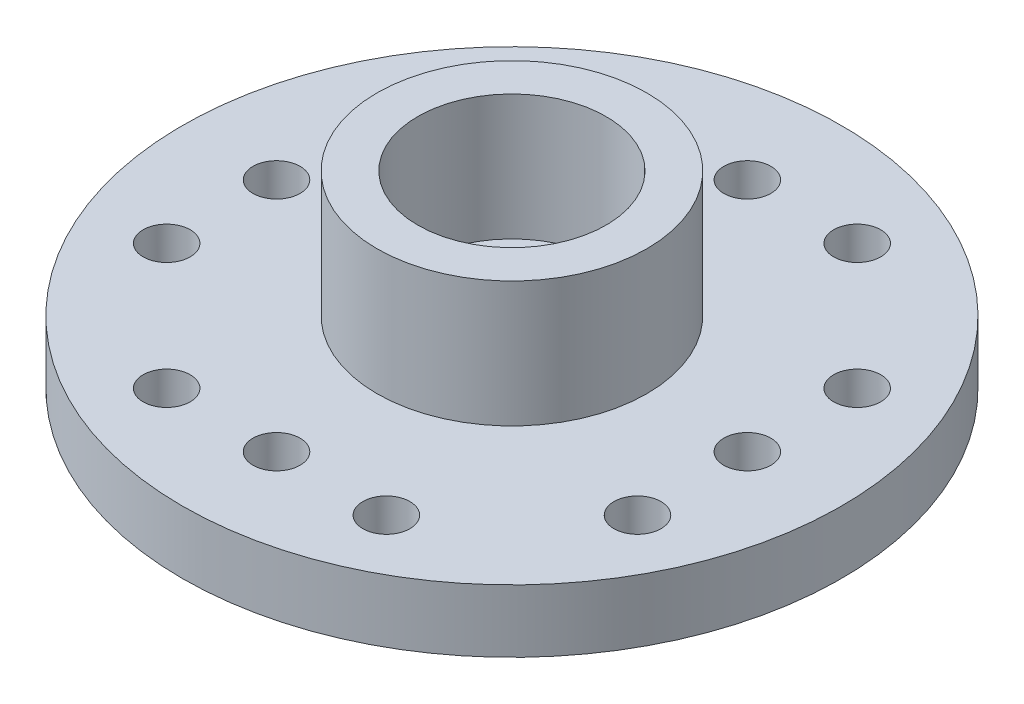
ISO-10303-21;
HEADER;
FILE_DESCRIPTION(('STEP AP214'),'2;1');
FILE_NAME('part.step','',(''),(''),'','','');
FILE_SCHEMA(('AUTOMOTIVE_DESIGN { 1 0 10303 214 1 1 1 1 }'));
ENDSEC;
DATA;
#1=APPLICATION_CONTEXT('core data for automotive mechanical design processes');
#2=APPLICATION_PROTOCOL_DEFINITION('international standard','automotive_design',2000,#1);
#3=PRODUCT_CONTEXT('',#1,'mechanical');
#4=PRODUCT('Part','Part','',(#3));
#5=PRODUCT_RELATED_PRODUCT_CATEGORY('part','',(#4));
#6=PRODUCT_DEFINITION_FORMATION('','',#4);
#7=PRODUCT_DEFINITION_CONTEXT('part definition',#1,'design');
#8=PRODUCT_DEFINITION('design','',#6,#7);
#9=PRODUCT_DEFINITION_SHAPE('','',#8);
#10=(LENGTH_UNIT() NAMED_UNIT(*) SI_UNIT(.MILLI.,.METRE.));
#11=(NAMED_UNIT(*) PLANE_ANGLE_UNIT() SI_UNIT($,.RADIAN.));
#12=(NAMED_UNIT(*) SI_UNIT($,.STERADIAN.) SOLID_ANGLE_UNIT());
#13=UNCERTAINTY_MEASURE_WITH_UNIT(LENGTH_MEASURE(1.E-05),#10,'distance_accuracy_value','');
#14=(GEOMETRIC_REPRESENTATION_CONTEXT(3) GLOBAL_UNCERTAINTY_ASSIGNED_CONTEXT((#13)) GLOBAL_UNIT_ASSIGNED_CONTEXT((#10,
#11,#12)) REPRESENTATION_CONTEXT('',''));
#15=CARTESIAN_POINT('',(0.,0.,0.));
#16=DIRECTION('',(0.,0.,1.));
#17=DIRECTION('',(1.,0.,0.));
#18=AXIS2_PLACEMENT_3D('',#15,#16,#17);
#19=CARTESIAN_POINT('',(0.,0.,0.));
#20=DIRECTION('',(0.,1.,0.));
#21=DIRECTION('',(0.,0.,1.));
#22=AXIS2_PLACEMENT_3D('',#19,#20,#21);
#23=PLANE('',#22);
#24=CARTESIAN_POINT('',(-7.49999999999916,0.,3.50000000000044));
#25=DIRECTION('',(0.,1.,0.));
#26=DIRECTION('',(0.,0.,1.));
#27=AXIS2_PLACEMENT_3D('',#24,#25,#26);
#28=CIRCLE('',#27,0.749999999999759);
#29=CARTESIAN_POINT('',(-7.49999999999916,0.,4.2500000000002));
#30=VERTEX_POINT('',#29);
#31=EDGE_CURVE('E95',#30,#30,#28,.F.);
#32=ORIENTED_EDGE('',*,*,#31,.F.);
#33=EDGE_LOOP('',(#32));
#34=FACE_BOUND('',#33,.T.);
#35=CARTESIAN_POINT('',(-7.49999999999916,0.,4.40862624184729E-13));
#36=DIRECTION('',(0.,1.,0.));
#37=DIRECTION('',(0.,0.,1.));
#38=AXIS2_PLACEMENT_3D('',#35,#36,#37);
#39=CIRCLE('',#38,0.750000000000742);
#40=CARTESIAN_POINT('',(-7.49999999999916,0.,0.750000000001182));
#41=VERTEX_POINT('',#40);
#42=EDGE_CURVE('E102',#41,#41,#39,.F.);
#43=ORIENTED_EDGE('',*,*,#42,.F.);
#44=EDGE_LOOP('',(#43));
#45=FACE_BOUND('',#44,.T.);
#46=CARTESIAN_POINT('',(-7.49999999999916,0.,-3.49999999999956));
#47=DIRECTION('',(0.,1.,0.));
#48=DIRECTION('',(0.,0.,1.));
#49=AXIS2_PLACEMENT_3D('',#46,#47,#48);
#50=CIRCLE('',#49,0.75000000000073);
#51=CARTESIAN_POINT('',(-7.49999999999916,0.,-2.74999999999883));
#52=VERTEX_POINT('',#51);
#53=EDGE_CURVE('E108',#52,#52,#50,.F.);
#54=ORIENTED_EDGE('',*,*,#53,.F.);
#55=EDGE_LOOP('',(#54));
#56=FACE_BOUND('',#55,.T.);
#57=CARTESIAN_POINT('',(3.50000000000128,0.,7.4999999999996));
#58=DIRECTION('',(0.,1.,0.));
#59=DIRECTION('',(0.,0.,1.));
#60=AXIS2_PLACEMENT_3D('',#57,#58,#59);
#61=CIRCLE('',#60,0.749999999998852);
#62=CARTESIAN_POINT('',(3.50000000000128,0.,8.24999999999845));
#63=VERTEX_POINT('',#62);
#64=EDGE_CURVE('E114',#63,#63,#61,.F.);
#65=ORIENTED_EDGE('',*,*,#64,.F.);
#66=EDGE_LOOP('',(#65));
#67=FACE_BOUND('',#66,.T.);
#68=CARTESIAN_POINT('',(1.27713995416943E-12,0.,7.4999999999996));
#69=DIRECTION('',(0.,1.,0.));
#70=DIRECTION('',(0.,0.,1.));
#71=AXIS2_PLACEMENT_3D('',#68,#69,#70);
#72=CIRCLE('',#71,0.750000000001387);
#73=CARTESIAN_POINT('',(1.27713995416943E-12,0.,8.25000000000099));
#74=VERTEX_POINT('',#73);
#75=EDGE_CURVE('E120',#74,#74,#72,.F.);
#76=ORIENTED_EDGE('',*,*,#75,.F.);
#77=EDGE_LOOP('',(#76));
#78=FACE_BOUND('',#77,.T.);
#79=CARTESIAN_POINT('',(-3.49999999999872,0.,7.4999999999996));
#80=DIRECTION('',(0.,1.,0.));
#81=DIRECTION('',(0.,0.,1.));
#82=AXIS2_PLACEMENT_3D('',#79,#80,#81);
#83=CIRCLE('',#82,0.75000000000138);
#84=CARTESIAN_POINT('',(-3.49999999999872,0.,8.25000000000098));
#85=VERTEX_POINT('',#84);
#86=EDGE_CURVE('E72',#85,#85,#83,.F.);
#87=ORIENTED_EDGE('',*,*,#86,.F.);
#88=EDGE_LOOP('',(#87));
#89=FACE_BOUND('',#88,.T.);
#90=CARTESIAN_POINT('',(7.50000000000044,0.,-3.50000000000084));
#91=DIRECTION('',(0.,1.,0.));
#92=DIRECTION('',(0.,0.,1.));
#93=AXIS2_PLACEMENT_3D('',#90,#91,#92);
#94=CIRCLE('',#93,0.74999999999905);
#95=CARTESIAN_POINT('',(7.50000000000044,0.,-2.75000000000179));
#96=VERTEX_POINT('',#95);
#97=EDGE_CURVE('E65',#96,#96,#94,.F.);
#98=ORIENTED_EDGE('',*,*,#97,.F.);
#99=EDGE_LOOP('',(#98));
#100=FACE_BOUND('',#99,.T.);
#101=CARTESIAN_POINT('',(7.50000000000044,0.,-8.37195815084057E-13));
#102=DIRECTION('',(0.,1.,0.));
#103=DIRECTION('',(0.,0.,1.));
#104=AXIS2_PLACEMENT_3D('',#101,#102,#103);
#105=CIRCLE('',#104,0.750000000000697);
#106=CARTESIAN_POINT('',(7.50000000000044,0.,0.74999999999986));
#107=VERTEX_POINT('',#106);
#108=EDGE_CURVE('E73',#107,#107,#105,.F.);
#109=ORIENTED_EDGE('',*,*,#108,.F.);
#110=EDGE_LOOP('',(#109));
#111=FACE_BOUND('',#110,.T.);
#112=CARTESIAN_POINT('',(7.50000000000044,0.,3.49999999999916));
#113=DIRECTION('',(0.,1.,0.));
#114=DIRECTION('',(0.,0.,1.));
#115=AXIS2_PLACEMENT_3D('',#112,#113,#114);
#116=CIRCLE('',#115,0.750000000000693);
#117=CARTESIAN_POINT('',(7.50000000000044,0.,4.24999999999986));
#118=VERTEX_POINT('',#117);
#119=EDGE_CURVE('E79',#118,#118,#116,.F.);
#120=ORIENTED_EDGE('',*,*,#119,.F.);
#121=EDGE_LOOP('',(#120));
#122=FACE_BOUND('',#121,.T.);
#123=CARTESIAN_POINT('',(-3.5,0.,-7.5));
#124=DIRECTION('',(0.,1.,0.));
#125=DIRECTION('',(0.,0.,1.));
#126=AXIS2_PLACEMENT_3D('',#123,#124,#125);
#127=CIRCLE('',#126,0.75);
#128=CARTESIAN_POINT('',(-3.5,0.,-6.75));
#129=VERTEX_POINT('',#128);
#130=EDGE_CURVE('E85',#129,#129,#127,.F.);
#131=ORIENTED_EDGE('',*,*,#130,.F.);
#132=EDGE_LOOP('',(#131));
#133=FACE_BOUND('',#132,.T.);
#134=CARTESIAN_POINT('',(0.,0.,-7.5));
#135=DIRECTION('',(0.,1.,0.));
#136=DIRECTION('',(0.,0.,1.));
#137=AXIS2_PLACEMENT_3D('',#134,#135,#136);
#138=CIRCLE('',#137,0.75);
#139=CARTESIAN_POINT('',(0.,0.,-6.75));
#140=VERTEX_POINT('',#139);
#141=EDGE_CURVE('E64',#140,#140,#138,.F.);
#142=ORIENTED_EDGE('',*,*,#141,.F.);
#143=EDGE_LOOP('',(#142));
#144=FACE_BOUND('',#143,.T.);
#145=CARTESIAN_POINT('',(3.5,0.,-7.5));
#146=DIRECTION('',(0.,1.,0.));
#147=DIRECTION('',(0.,0.,1.));
#148=AXIS2_PLACEMENT_3D('',#145,#146,#147);
#149=CIRCLE('',#148,0.75);
#150=CARTESIAN_POINT('',(3.5,0.,-6.75));
#151=VERTEX_POINT('',#150);
#152=EDGE_CURVE('E58',#151,#151,#149,.F.);
#153=ORIENTED_EDGE('',*,*,#152,.F.);
#154=EDGE_LOOP('',(#153));
#155=FACE_BOUND('',#154,.T.);
#156=CARTESIAN_POINT('',(0.,0.,0.));
#157=DIRECTION('',(0.,1.,0.));
#158=DIRECTION('',(0.,0.,1.));
#159=AXIS2_PLACEMENT_3D('',#156,#157,#158);
#160=CIRCLE('',#159,10.5);
#161=CARTESIAN_POINT('',(0.,0.,10.5));
#162=VERTEX_POINT('',#161);
#163=EDGE_CURVE('E10',#162,#162,#160,.T.);
#164=ORIENTED_EDGE('',*,*,#163,.F.);
#165=EDGE_LOOP('',(#164));
#166=FACE_BOUND('',#165,.T.);
#167=ADVANCED_FACE('F33',(#34,#45,#56,#67,#78,#89,#100,#111,#122,#133,#144,#155,#166),#23,.F.);
#168=CARTESIAN_POINT('',(0.,2.,0.));
#169=DIRECTION('',(0.,1.,0.));
#170=DIRECTION('',(0.,0.,1.));
#171=AXIS2_PLACEMENT_3D('',#168,#169,#170);
#172=CYLINDRICAL_SURFACE('',#171,10.5);
#173=CARTESIAN_POINT('',(0.,2.,0.));
#174=DIRECTION('',(0.,1.,0.));
#175=DIRECTION('',(0.,0.,1.));
#176=AXIS2_PLACEMENT_3D('',#173,#174,#175);
#177=CIRCLE('',#176,10.5);
#178=CARTESIAN_POINT('',(0.,2.,10.5));
#179=VERTEX_POINT('',#178);
#180=EDGE_CURVE('E39',#179,#179,#177,.T.);
#181=ORIENTED_EDGE('',*,*,#180,.F.);
#182=EDGE_LOOP('',(#181));
#183=FACE_BOUND('',#182,.T.);
#184=ORIENTED_EDGE('',*,*,#163,.T.);
#185=EDGE_LOOP('',(#184));
#186=FACE_BOUND('',#185,.T.);
#187=ADVANCED_FACE('F138',(#183,#186),#172,.T.);
#188=CARTESIAN_POINT('',(10.5,2.,0.));
#189=DIRECTION('',(0.,-1.,0.));
#190=DIRECTION('',(0.,0.,-1.));
#191=AXIS2_PLACEMENT_3D('',#188,#189,#190);
#192=PLANE('',#191);
#193=CARTESIAN_POINT('',(-7.49999999999916,2.,3.50000000000044));
#194=DIRECTION('',(0.,1.,0.));
#195=DIRECTION('',(0.,0.,-1.));
#196=AXIS2_PLACEMENT_3D('',#193,#194,#195);
#197=CIRCLE('',#196,0.749999999999759);
#198=CARTESIAN_POINT('',(-7.49999999999916,2.,2.75000000000068));
#199=VERTEX_POINT('',#198);
#200=EDGE_CURVE('E99',#199,#199,#197,.T.);
#201=ORIENTED_EDGE('',*,*,#200,.F.);
#202=EDGE_LOOP('',(#201));
#203=FACE_BOUND('',#202,.T.);
#204=CARTESIAN_POINT('',(-7.49999999999916,2.,4.40862624184729E-13));
#205=DIRECTION('',(0.,1.,0.));
#206=DIRECTION('',(0.,0.,1.));
#207=AXIS2_PLACEMENT_3D('',#204,#205,#206);
#208=CIRCLE('',#207,0.750000000000742);
#209=CARTESIAN_POINT('',(-7.49999999999916,2.,0.750000000001182));
#210=VERTEX_POINT('',#209);
#211=EDGE_CURVE('E98',#210,#210,#208,.T.);
#212=ORIENTED_EDGE('',*,*,#211,.F.);
#213=EDGE_LOOP('',(#212));
#214=FACE_BOUND('',#213,.T.);
#215=CARTESIAN_POINT('',(-7.49999999999916,2.,-3.49999999999956));
#216=DIRECTION('',(0.,1.,0.));
#217=DIRECTION('',(0.,0.,1.));
#218=AXIS2_PLACEMENT_3D('',#215,#216,#217);
#219=CIRCLE('',#218,0.75000000000073);
#220=CARTESIAN_POINT('',(-7.49999999999916,2.,-2.74999999999883));
#221=VERTEX_POINT('',#220);
#222=EDGE_CURVE('E105',#221,#221,#219,.T.);
#223=ORIENTED_EDGE('',*,*,#222,.F.);
#224=EDGE_LOOP('',(#223));
#225=FACE_BOUND('',#224,.T.);
#226=CARTESIAN_POINT('',(3.50000000000128,2.,7.4999999999996));
#227=DIRECTION('',(0.,1.,0.));
#228=DIRECTION('',(0.,0.,-1.));
#229=AXIS2_PLACEMENT_3D('',#226,#227,#228);
#230=CIRCLE('',#229,0.749999999998852);
#231=CARTESIAN_POINT('',(3.50000000000128,2.,6.75000000000075));
#232=VERTEX_POINT('',#231);
#233=EDGE_CURVE('E111',#232,#232,#230,.T.);
#234=ORIENTED_EDGE('',*,*,#233,.F.);
#235=EDGE_LOOP('',(#234));
#236=FACE_BOUND('',#235,.T.);
#237=CARTESIAN_POINT('',(1.27713995416943E-12,2.,7.4999999999996));
#238=DIRECTION('',(0.,1.,0.));
#239=DIRECTION('',(0.,0.,1.));
#240=AXIS2_PLACEMENT_3D('',#237,#238,#239);
#241=CIRCLE('',#240,0.750000000001387);
#242=CARTESIAN_POINT('',(1.27713995416943E-12,2.,8.25000000000099));
#243=VERTEX_POINT('',#242);
#244=EDGE_CURVE('E117',#243,#243,#241,.T.);
#245=ORIENTED_EDGE('',*,*,#244,.F.);
#246=EDGE_LOOP('',(#245));
#247=FACE_BOUND('',#246,.T.);
#248=CARTESIAN_POINT('',(-3.49999999999872,2.,7.4999999999996));
#249=DIRECTION('',(0.,1.,0.));
#250=DIRECTION('',(0.,0.,1.));
#251=AXIS2_PLACEMENT_3D('',#248,#249,#250);
#252=CIRCLE('',#251,0.75000000000138);
#253=CARTESIAN_POINT('',(-3.49999999999872,2.,8.25000000000098));
#254=VERTEX_POINT('',#253);
#255=EDGE_CURVE('E123',#254,#254,#252,.T.);
#256=ORIENTED_EDGE('',*,*,#255,.F.);
#257=EDGE_LOOP('',(#256));
#258=FACE_BOUND('',#257,.T.);
#259=CARTESIAN_POINT('',(7.50000000000044,2.,-3.50000000000084));
#260=DIRECTION('',(0.,1.,0.));
#261=DIRECTION('',(0.,0.,-1.));
#262=AXIS2_PLACEMENT_3D('',#259,#260,#261);
#263=CIRCLE('',#262,0.74999999999905);
#264=CARTESIAN_POINT('',(7.50000000000044,2.,-4.24999999999989));
#265=VERTEX_POINT('',#264);
#266=EDGE_CURVE('E69',#265,#265,#263,.T.);
#267=ORIENTED_EDGE('',*,*,#266,.F.);
#268=EDGE_LOOP('',(#267));
#269=FACE_BOUND('',#268,.T.);
#270=CARTESIAN_POINT('',(7.50000000000044,2.,-8.37195815084057E-13));
#271=DIRECTION('',(0.,1.,0.));
#272=DIRECTION('',(0.,0.,1.));
#273=AXIS2_PLACEMENT_3D('',#270,#271,#272);
#274=CIRCLE('',#273,0.750000000000697);
#275=CARTESIAN_POINT('',(7.50000000000044,2.,0.74999999999986));
#276=VERTEX_POINT('',#275);
#277=EDGE_CURVE('E68',#276,#276,#274,.T.);
#278=ORIENTED_EDGE('',*,*,#277,.F.);
#279=EDGE_LOOP('',(#278));
#280=FACE_BOUND('',#279,.T.);
#281=CARTESIAN_POINT('',(7.50000000000044,2.,3.49999999999916));
#282=DIRECTION('',(0.,1.,0.));
#283=DIRECTION('',(0.,0.,1.));
#284=AXIS2_PLACEMENT_3D('',#281,#282,#283);
#285=CIRCLE('',#284,0.750000000000693);
#286=CARTESIAN_POINT('',(7.50000000000044,2.,4.24999999999986));
#287=VERTEX_POINT('',#286);
#288=EDGE_CURVE('E76',#287,#287,#285,.T.);
#289=ORIENTED_EDGE('',*,*,#288,.F.);
#290=EDGE_LOOP('',(#289));
#291=FACE_BOUND('',#290,.T.);
#292=CARTESIAN_POINT('',(-3.5,2.,-7.5));
#293=DIRECTION('',(0.,1.,0.));
#294=DIRECTION('',(0.,0.,-1.));
#295=AXIS2_PLACEMENT_3D('',#292,#293,#294);
#296=CIRCLE('',#295,0.75);
#297=CARTESIAN_POINT('',(-3.5,2.,-8.25));
#298=VERTEX_POINT('',#297);
#299=EDGE_CURVE('E82',#298,#298,#296,.T.);
#300=ORIENTED_EDGE('',*,*,#299,.F.);
#301=EDGE_LOOP('',(#300));
#302=FACE_BOUND('',#301,.T.);
#303=CARTESIAN_POINT('',(0.,2.,-7.5));
#304=DIRECTION('',(0.,1.,0.));
#305=DIRECTION('',(0.,0.,1.));
#306=AXIS2_PLACEMENT_3D('',#303,#304,#305);
#307=CIRCLE('',#306,0.75);
#308=CARTESIAN_POINT('',(0.,2.,-6.75));
#309=VERTEX_POINT('',#308);
#310=EDGE_CURVE('E88',#309,#309,#307,.T.);
#311=ORIENTED_EDGE('',*,*,#310,.F.);
#312=EDGE_LOOP('',(#311));
#313=FACE_BOUND('',#312,.T.);
#314=CARTESIAN_POINT('',(3.5,2.,-7.5));
#315=DIRECTION('',(0.,1.,0.));
#316=DIRECTION('',(0.,0.,1.));
#317=AXIS2_PLACEMENT_3D('',#314,#315,#316);
#318=CIRCLE('',#317,0.75);
#319=CARTESIAN_POINT('',(3.5,2.,-6.75));
#320=VERTEX_POINT('',#319);
#321=EDGE_CURVE('E61',#320,#320,#318,.T.);
#322=ORIENTED_EDGE('',*,*,#321,.F.);
#323=EDGE_LOOP('',(#322));
#324=FACE_BOUND('',#323,.T.);
#325=CARTESIAN_POINT('',(0.,2.,0.));
#326=DIRECTION('',(0.,1.,0.));
#327=DIRECTION('',(0.,0.,1.));
#328=AXIS2_PLACEMENT_3D('',#325,#326,#327);
#329=CIRCLE('',#328,4.3);
#330=CARTESIAN_POINT('',(0.,2.,4.3));
#331=VERTEX_POINT('',#330);
#332=EDGE_CURVE('E43',#331,#331,#329,.T.);
#333=ORIENTED_EDGE('',*,*,#332,.F.);
#334=EDGE_LOOP('',(#333));
#335=FACE_BOUND('',#334,.T.);
#336=ORIENTED_EDGE('',*,*,#180,.T.);
#337=EDGE_LOOP('',(#336));
#338=FACE_BOUND('',#337,.T.);
#339=ADVANCED_FACE('F134',(#203,#214,#225,#236,#247,#258,#269,#280,#291,#302,#313,#324,#335,
#338),#192,.F.);
#340=CARTESIAN_POINT('',(0.,2.,0.));
#341=DIRECTION('',(0.,1.,0.));
#342=DIRECTION('',(0.,0.,1.));
#343=AXIS2_PLACEMENT_3D('',#340,#341,#342);
#344=CYLINDRICAL_SURFACE('',#343,4.3);
#345=CARTESIAN_POINT('',(0.,6.,0.));
#346=DIRECTION('',(0.,1.,0.));
#347=DIRECTION('',(0.,0.,1.));
#348=AXIS2_PLACEMENT_3D('',#345,#346,#347);
#349=CIRCLE('',#348,4.3);
#350=CARTESIAN_POINT('',(0.,6.,4.3));
#351=VERTEX_POINT('',#350);
#352=EDGE_CURVE('E47',#351,#351,#349,.T.);
#353=ORIENTED_EDGE('',*,*,#352,.F.);
#354=EDGE_LOOP('',(#353));
#355=FACE_BOUND('',#354,.T.);
#356=ORIENTED_EDGE('',*,*,#332,.T.);
#357=EDGE_LOOP('',(#356));
#358=FACE_BOUND('',#357,.T.);
#359=ADVANCED_FACE('F137',(#355,#358),#344,.T.);
#360=CARTESIAN_POINT('',(4.3,6.,0.));
#361=DIRECTION('',(0.,-1.,0.));
#362=DIRECTION('',(0.,0.,-1.));
#363=AXIS2_PLACEMENT_3D('',#360,#361,#362);
#364=PLANE('',#363);
#365=CARTESIAN_POINT('',(0.,6.,0.));
#366=DIRECTION('',(0.,1.,0.));
#367=DIRECTION('',(0.,0.,1.));
#368=AXIS2_PLACEMENT_3D('',#365,#366,#367);
#369=CIRCLE('',#368,3.);
#370=CARTESIAN_POINT('',(0.,6.,3.));
#371=VERTEX_POINT('',#370);
#372=EDGE_CURVE('E52',#371,#371,#369,.T.);
#373=ORIENTED_EDGE('',*,*,#372,.F.);
#374=EDGE_LOOP('',(#373));
#375=FACE_BOUND('',#374,.T.);
#376=ORIENTED_EDGE('',*,*,#352,.T.);
#377=EDGE_LOOP('',(#376));
#378=FACE_BOUND('',#377,.T.);
#379=ADVANCED_FACE('F156',(#375,#378),#364,.F.);
#380=CARTESIAN_POINT('',(0.,2.,0.));
#381=DIRECTION('',(0.,1.,0.));
#382=DIRECTION('',(0.,0.,1.));
#383=AXIS2_PLACEMENT_3D('',#380,#381,#382);
#384=CYLINDRICAL_SURFACE('',#383,3.);
#385=CARTESIAN_POINT('',(0.,2.,0.));
#386=DIRECTION('',(0.,1.,0.));
#387=DIRECTION('',(0.,0.,1.));
#388=AXIS2_PLACEMENT_3D('',#385,#386,#387);
#389=CIRCLE('',#388,3.);
#390=CARTESIAN_POINT('',(0.,2.,3.));
#391=VERTEX_POINT('',#390);
#392=EDGE_CURVE('E55',#391,#391,#389,.T.);
#393=ORIENTED_EDGE('',*,*,#392,.F.);
#394=EDGE_LOOP('',(#393));
#395=FACE_BOUND('',#394,.T.);
#396=ORIENTED_EDGE('',*,*,#372,.T.);
#397=EDGE_LOOP('',(#396));
#398=FACE_BOUND('',#397,.T.);
#399=ADVANCED_FACE('F162',(#395,#398),#384,.F.);
#400=CARTESIAN_POINT('',(3.,2.,0.));
#401=DIRECTION('',(0.,-1.,0.));
#402=DIRECTION('',(0.,0.,-1.));
#403=AXIS2_PLACEMENT_3D('',#400,#401,#402);
#404=PLANE('',#403);
#405=ORIENTED_EDGE('',*,*,#392,.T.);
#406=EDGE_LOOP('',(#405));
#407=FACE_BOUND('',#406,.T.);
#408=ADVANCED_FACE('F200',(#407),#404,.F.);
#409=CARTESIAN_POINT('',(3.5,-0.00100000000000013,-7.5));
#410=DIRECTION('',(0.,1.,0.));
#411=DIRECTION('',(0.,0.,1.));
#412=AXIS2_PLACEMENT_3D('',#409,#410,#411);
#413=CYLINDRICAL_SURFACE('',#412,0.75);
#414=ORIENTED_EDGE('',*,*,#321,.T.);
#415=EDGE_LOOP('',(#414));
#416=FACE_BOUND('',#415,.T.);
#417=ORIENTED_EDGE('',*,*,#152,.T.);
#418=EDGE_LOOP('',(#417));
#419=FACE_BOUND('',#418,.T.);
#420=ADVANCED_FACE('F197',(#416,#419),#413,.F.);
#421=CARTESIAN_POINT('',(0.,-0.00100000000000013,-7.5));
#422=DIRECTION('',(0.,1.,0.));
#423=DIRECTION('',(0.,0.,1.));
#424=AXIS2_PLACEMENT_3D('',#421,#422,#423);
#425=CYLINDRICAL_SURFACE('',#424,0.75);
#426=ORIENTED_EDGE('',*,*,#310,.T.);
#427=EDGE_LOOP('',(#426));
#428=FACE_BOUND('',#427,.T.);
#429=ORIENTED_EDGE('',*,*,#141,.T.);
#430=EDGE_LOOP('',(#429));
#431=FACE_BOUND('',#430,.T.);
#432=ADVANCED_FACE('F199',(#428,#431),#425,.F.);
#433=CARTESIAN_POINT('',(-3.5,-0.00100000000000013,-7.5));
#434=DIRECTION('',(0.,1.,0.));
#435=DIRECTION('',(0.,0.,1.));
#436=AXIS2_PLACEMENT_3D('',#433,#434,#435);
#437=CYLINDRICAL_SURFACE('',#436,0.75);
#438=ORIENTED_EDGE('',*,*,#299,.T.);
#439=EDGE_LOOP('',(#438));
#440=FACE_BOUND('',#439,.T.);
#441=ORIENTED_EDGE('',*,*,#130,.T.);
#442=EDGE_LOOP('',(#441));
#443=FACE_BOUND('',#442,.T.);
#444=ADVANCED_FACE('F207',(#440,#443),#437,.F.);
#445=CARTESIAN_POINT('',(7.50000000000044,-0.00100000000000013,3.49999999999916));
#446=DIRECTION('',(0.,1.,0.));
#447=DIRECTION('',(0.,0.,1.));
#448=AXIS2_PLACEMENT_3D('',#445,#446,#447);
#449=CYLINDRICAL_SURFACE('',#448,0.750000000000693);
#450=ORIENTED_EDGE('',*,*,#288,.T.);
#451=EDGE_LOOP('',(#450));
#452=FACE_BOUND('',#451,.T.);
#453=ORIENTED_EDGE('',*,*,#119,.T.);
#454=EDGE_LOOP('',(#453));
#455=FACE_BOUND('',#454,.T.);
#456=ADVANCED_FACE('F261',(#452,#455),#449,.F.);
#457=CARTESIAN_POINT('',(7.50000000000044,-0.00100000000000013,-8.37195815084057E-13));
#458=DIRECTION('',(0.,1.,0.));
#459=DIRECTION('',(0.,0.,1.));
#460=AXIS2_PLACEMENT_3D('',#457,#458,#459);
#461=CYLINDRICAL_SURFACE('',#460,0.750000000000697);
#462=ORIENTED_EDGE('',*,*,#277,.T.);
#463=EDGE_LOOP('',(#462));
#464=FACE_BOUND('',#463,.T.);
#465=ORIENTED_EDGE('',*,*,#108,.T.);
#466=EDGE_LOOP('',(#465));
#467=FACE_BOUND('',#466,.T.);
#468=ADVANCED_FACE('F271',(#464,#467),#461,.F.);
#469=CARTESIAN_POINT('',(7.50000000000044,-0.00100000000000013,-3.50000000000084));
#470=DIRECTION('',(0.,1.,0.));
#471=DIRECTION('',(0.,0.,1.));
#472=AXIS2_PLACEMENT_3D('',#469,#470,#471);
#473=CYLINDRICAL_SURFACE('',#472,0.74999999999905);
#474=ORIENTED_EDGE('',*,*,#266,.T.);
#475=EDGE_LOOP('',(#474));
#476=FACE_BOUND('',#475,.T.);
#477=ORIENTED_EDGE('',*,*,#97,.T.);
#478=EDGE_LOOP('',(#477));
#479=FACE_BOUND('',#478,.T.);
#480=ADVANCED_FACE('F213',(#476,#479),#473,.F.);
#481=CARTESIAN_POINT('',(-3.49999999999872,-0.00100000000000013,7.4999999999996));
#482=DIRECTION('',(0.,1.,0.));
#483=DIRECTION('',(0.,0.,1.));
#484=AXIS2_PLACEMENT_3D('',#481,#482,#483);
#485=CYLINDRICAL_SURFACE('',#484,0.75000000000138);
#486=ORIENTED_EDGE('',*,*,#255,.T.);
#487=EDGE_LOOP('',(#486));
#488=FACE_BOUND('',#487,.T.);
#489=ORIENTED_EDGE('',*,*,#86,.T.);
#490=EDGE_LOOP('',(#489));
#491=FACE_BOUND('',#490,.T.);
#492=ADVANCED_FACE('F131',(#488,#491),#485,.F.);
#493=CARTESIAN_POINT('',(1.27713995416943E-12,-0.00100000000000013,7.4999999999996));
#494=DIRECTION('',(0.,1.,0.));
#495=DIRECTION('',(0.,0.,1.));
#496=AXIS2_PLACEMENT_3D('',#493,#494,#495);
#497=CYLINDRICAL_SURFACE('',#496,0.750000000001387);
#498=ORIENTED_EDGE('',*,*,#244,.T.);
#499=EDGE_LOOP('',(#498));
#500=FACE_BOUND('',#499,.T.);
#501=ORIENTED_EDGE('',*,*,#75,.T.);
#502=EDGE_LOOP('',(#501));
#503=FACE_BOUND('',#502,.T.);
#504=ADVANCED_FACE('F297',(#500,#503),#497,.F.);
#505=CARTESIAN_POINT('',(3.50000000000128,-0.00100000000000013,7.4999999999996));
#506=DIRECTION('',(0.,1.,0.));
#507=DIRECTION('',(0.,0.,1.));
#508=AXIS2_PLACEMENT_3D('',#505,#506,#507);
#509=CYLINDRICAL_SURFACE('',#508,0.749999999998852);
#510=ORIENTED_EDGE('',*,*,#233,.T.);
#511=EDGE_LOOP('',(#510));
#512=FACE_BOUND('',#511,.T.);
#513=ORIENTED_EDGE('',*,*,#64,.T.);
#514=EDGE_LOOP('',(#513));
#515=FACE_BOUND('',#514,.T.);
#516=ADVANCED_FACE('F306',(#512,#515),#509,.F.);
#517=CARTESIAN_POINT('',(-7.49999999999916,-0.00100000000000013,-3.49999999999956));
#518=DIRECTION('',(0.,1.,0.));
#519=DIRECTION('',(0.,0.,1.));
#520=AXIS2_PLACEMENT_3D('',#517,#518,#519);
#521=CYLINDRICAL_SURFACE('',#520,0.75000000000073);
#522=ORIENTED_EDGE('',*,*,#222,.T.);
#523=EDGE_LOOP('',(#522));
#524=FACE_BOUND('',#523,.T.);
#525=ORIENTED_EDGE('',*,*,#53,.T.);
#526=EDGE_LOOP('',(#525));
#527=FACE_BOUND('',#526,.T.);
#528=ADVANCED_FACE('F316',(#524,#527),#521,.F.);
#529=CARTESIAN_POINT('',(-7.49999999999916,-0.00100000000000013,4.40862624184729E-13));
#530=DIRECTION('',(0.,1.,0.));
#531=DIRECTION('',(0.,0.,1.));
#532=AXIS2_PLACEMENT_3D('',#529,#530,#531);
#533=CYLINDRICAL_SURFACE('',#532,0.750000000000742);
#534=ORIENTED_EDGE('',*,*,#211,.T.);
#535=EDGE_LOOP('',(#534));
#536=FACE_BOUND('',#535,.T.);
#537=ORIENTED_EDGE('',*,*,#42,.T.);
#538=EDGE_LOOP('',(#537));
#539=FACE_BOUND('',#538,.T.);
#540=ADVANCED_FACE('F326',(#536,#539),#533,.F.);
#541=CARTESIAN_POINT('',(-7.49999999999916,-0.00100000000000013,3.50000000000044));
#542=DIRECTION('',(0.,1.,0.));
#543=DIRECTION('',(0.,0.,1.));
#544=AXIS2_PLACEMENT_3D('',#541,#542,#543);
#545=CYLINDRICAL_SURFACE('',#544,0.749999999999759);
#546=ORIENTED_EDGE('',*,*,#200,.T.);
#547=EDGE_LOOP('',(#546));
#548=FACE_BOUND('',#547,.T.);
#549=ORIENTED_EDGE('',*,*,#31,.T.);
#550=EDGE_LOOP('',(#549));
#551=FACE_BOUND('',#550,.T.);
#552=ADVANCED_FACE('F336',(#548,#551),#545,.F.);
#553=CLOSED_SHELL('',(#167,#187,#339,#359,#379,#399,#408,#420,#432,#444,#456,#468,#480,#492,
#504,#516,#528,#540,#552));
#554=MANIFOLD_SOLID_BREP('B2',#553);
#555=ADVANCED_BREP_SHAPE_REPRESENTATION('',(#18,#554),#14);
#556=SHAPE_DEFINITION_REPRESENTATION(#9,#555);
ENDSEC;
END-ISO-10303-21;
